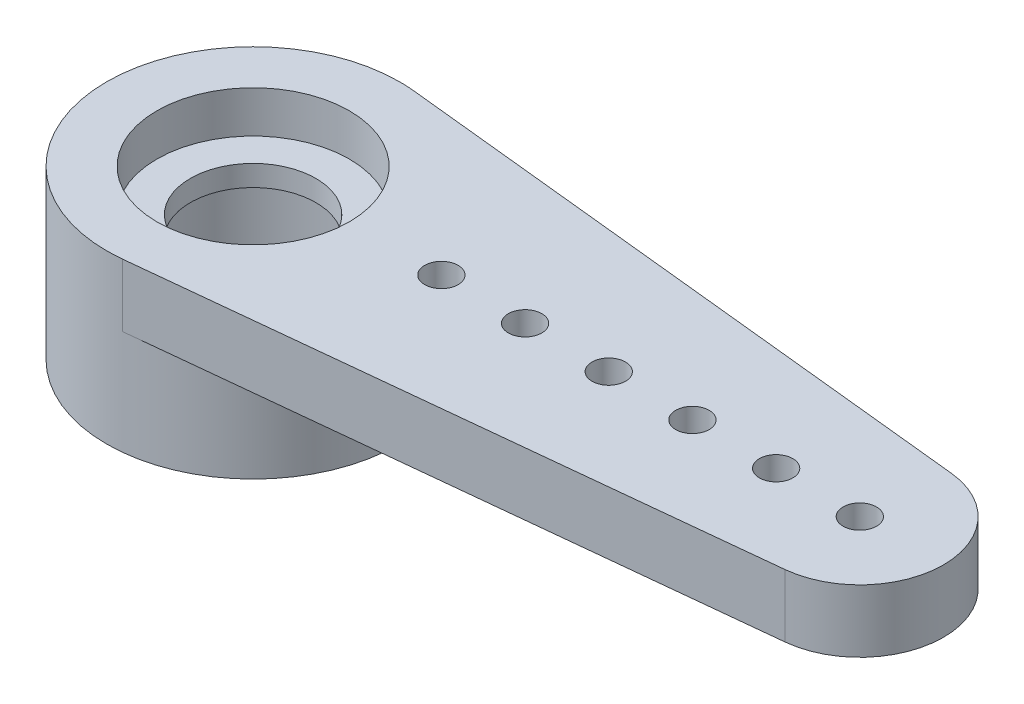
ISO-10303-21;
HEADER;
FILE_DESCRIPTION(('STEP AP214'),'2;1');
FILE_NAME('part.step','',(''),(''),'','','');
FILE_SCHEMA(('AUTOMOTIVE_DESIGN { 1 0 10303 214 1 1 1 1 }'));
ENDSEC;
DATA;
#1=APPLICATION_CONTEXT('core data for automotive mechanical design processes');
#2=APPLICATION_PROTOCOL_DEFINITION('international standard','automotive_design',2000,#1);
#3=PRODUCT_CONTEXT('',#1,'mechanical');
#4=PRODUCT('Part','Part','',(#3));
#5=PRODUCT_RELATED_PRODUCT_CATEGORY('part','',(#4));
#6=PRODUCT_DEFINITION_FORMATION('','',#4);
#7=PRODUCT_DEFINITION_CONTEXT('part definition',#1,'design');
#8=PRODUCT_DEFINITION('design','',#6,#7);
#9=PRODUCT_DEFINITION_SHAPE('','',#8);
#10=(LENGTH_UNIT() NAMED_UNIT(*) SI_UNIT(.MILLI.,.METRE.));
#11=(NAMED_UNIT(*) PLANE_ANGLE_UNIT() SI_UNIT($,.RADIAN.));
#12=(NAMED_UNIT(*) SI_UNIT($,.STERADIAN.) SOLID_ANGLE_UNIT());
#13=UNCERTAINTY_MEASURE_WITH_UNIT(LENGTH_MEASURE(1.E-05),#10,'distance_accuracy_value','');
#14=(GEOMETRIC_REPRESENTATION_CONTEXT(3) GLOBAL_UNCERTAINTY_ASSIGNED_CONTEXT((#13)) GLOBAL_UNIT_ASSIGNED_CONTEXT((#10,
#11,#12)) REPRESENTATION_CONTEXT('',''));
#15=CARTESIAN_POINT('',(0.,0.,0.));
#16=DIRECTION('',(0.,0.,1.));
#17=DIRECTION('',(1.,0.,0.));
#18=AXIS2_PLACEMENT_3D('',#15,#16,#17);
#19=CARTESIAN_POINT('',(4.5,1.5,0.));
#20=DIRECTION('',(0.,-1.,0.));
#21=DIRECTION('',(0.,0.,-1.));
#22=AXIS2_PLACEMENT_3D('',#19,#20,#21);
#23=CYLINDRICAL_SURFACE('',#22,0.4);
#24=CARTESIAN_POINT('',(4.5,1.5,0.));
#25=DIRECTION('',(0.,1.,0.));
#26=DIRECTION('',(0.,0.,1.));
#27=AXIS2_PLACEMENT_3D('',#24,#25,#26);
#28=CIRCLE('',#27,0.4);
#29=CARTESIAN_POINT('',(4.5,1.5,0.4));
#30=VERTEX_POINT('',#29);
#31=EDGE_CURVE('E44',#30,#30,#28,.T.);
#32=ORIENTED_EDGE('',*,*,#31,.T.);
#33=EDGE_LOOP('',(#32));
#34=FACE_BOUND('',#33,.T.);
#35=CARTESIAN_POINT('',(4.5,0.,0.));
#36=DIRECTION('',(0.,1.,0.));
#37=DIRECTION('',(0.,0.,1.));
#38=AXIS2_PLACEMENT_3D('',#35,#36,#37);
#39=CIRCLE('',#38,0.4);
#40=CARTESIAN_POINT('',(4.5,0.,0.4));
#41=VERTEX_POINT('',#40);
#42=EDGE_CURVE('E11',#41,#41,#39,.T.);
#43=ORIENTED_EDGE('',*,*,#42,.F.);
#44=EDGE_LOOP('',(#43));
#45=FACE_BOUND('',#44,.T.);
#46=ADVANCED_FACE('F36',(#34,#45),#23,.F.);
#47=CARTESIAN_POINT('',(6.5,1.5,0.));
#48=DIRECTION('',(0.,-1.,0.));
#49=DIRECTION('',(0.,0.,-1.));
#50=AXIS2_PLACEMENT_3D('',#47,#48,#49);
#51=CYLINDRICAL_SURFACE('',#50,0.4);
#52=CARTESIAN_POINT('',(6.5,1.5,0.));
#53=DIRECTION('',(0.,1.,0.));
#54=DIRECTION('',(0.,0.,1.));
#55=AXIS2_PLACEMENT_3D('',#52,#53,#54);
#56=CIRCLE('',#55,0.4);
#57=CARTESIAN_POINT('',(6.5,1.5,0.4));
#58=VERTEX_POINT('',#57);
#59=EDGE_CURVE('E137',#58,#58,#56,.T.);
#60=ORIENTED_EDGE('',*,*,#59,.T.);
#61=EDGE_LOOP('',(#60));
#62=FACE_BOUND('',#61,.T.);
#63=CARTESIAN_POINT('',(6.5,0.,0.));
#64=DIRECTION('',(0.,1.,0.));
#65=DIRECTION('',(0.,0.,1.));
#66=AXIS2_PLACEMENT_3D('',#63,#64,#65);
#67=CIRCLE('',#66,0.4);
#68=CARTESIAN_POINT('',(6.5,0.,0.4));
#69=VERTEX_POINT('',#68);
#70=EDGE_CURVE('E140',#69,#69,#67,.T.);
#71=ORIENTED_EDGE('',*,*,#70,.F.);
#72=EDGE_LOOP('',(#71));
#73=FACE_BOUND('',#72,.T.);
#74=ADVANCED_FACE('F231',(#62,#73),#51,.F.);
#75=CARTESIAN_POINT('',(8.5,1.5,0.));
#76=DIRECTION('',(0.,-1.,0.));
#77=DIRECTION('',(0.,0.,-1.));
#78=AXIS2_PLACEMENT_3D('',#75,#76,#77);
#79=CYLINDRICAL_SURFACE('',#78,0.4);
#80=CARTESIAN_POINT('',(8.5,1.5,0.));
#81=DIRECTION('',(0.,1.,0.));
#82=DIRECTION('',(0.,0.,1.));
#83=AXIS2_PLACEMENT_3D('',#80,#81,#82);
#84=CIRCLE('',#83,0.4);
#85=CARTESIAN_POINT('',(8.5,1.5,0.4));
#86=VERTEX_POINT('',#85);
#87=EDGE_CURVE('E131',#86,#86,#84,.T.);
#88=ORIENTED_EDGE('',*,*,#87,.T.);
#89=EDGE_LOOP('',(#88));
#90=FACE_BOUND('',#89,.T.);
#91=CARTESIAN_POINT('',(8.5,0.,0.));
#92=DIRECTION('',(0.,1.,0.));
#93=DIRECTION('',(0.,0.,1.));
#94=AXIS2_PLACEMENT_3D('',#91,#92,#93);
#95=CIRCLE('',#94,0.4);
#96=CARTESIAN_POINT('',(8.5,0.,0.4));
#97=VERTEX_POINT('',#96);
#98=EDGE_CURVE('E134',#97,#97,#95,.T.);
#99=ORIENTED_EDGE('',*,*,#98,.F.);
#100=EDGE_LOOP('',(#99));
#101=FACE_BOUND('',#100,.T.);
#102=ADVANCED_FACE('F235',(#90,#101),#79,.F.);
#103=CARTESIAN_POINT('',(10.5,1.5,0.));
#104=DIRECTION('',(0.,-1.,0.));
#105=DIRECTION('',(0.,0.,-1.));
#106=AXIS2_PLACEMENT_3D('',#103,#104,#105);
#107=CYLINDRICAL_SURFACE('',#106,0.4);
#108=CARTESIAN_POINT('',(10.5,1.5,0.));
#109=DIRECTION('',(0.,1.,0.));
#110=DIRECTION('',(0.,0.,1.));
#111=AXIS2_PLACEMENT_3D('',#108,#109,#110);
#112=CIRCLE('',#111,0.4);
#113=CARTESIAN_POINT('',(10.5,1.5,0.4));
#114=VERTEX_POINT('',#113);
#115=EDGE_CURVE('E125',#114,#114,#112,.T.);
#116=ORIENTED_EDGE('',*,*,#115,.T.);
#117=EDGE_LOOP('',(#116));
#118=FACE_BOUND('',#117,.T.);
#119=CARTESIAN_POINT('',(10.5,0.,0.));
#120=DIRECTION('',(0.,1.,0.));
#121=DIRECTION('',(0.,0.,1.));
#122=AXIS2_PLACEMENT_3D('',#119,#120,#121);
#123=CIRCLE('',#122,0.4);
#124=CARTESIAN_POINT('',(10.5,0.,0.4));
#125=VERTEX_POINT('',#124);
#126=EDGE_CURVE('E128',#125,#125,#123,.T.);
#127=ORIENTED_EDGE('',*,*,#126,.F.);
#128=EDGE_LOOP('',(#127));
#129=FACE_BOUND('',#128,.T.);
#130=ADVANCED_FACE('F240',(#118,#129),#107,.F.);
#131=CARTESIAN_POINT('',(12.5,1.5,0.));
#132=DIRECTION('',(0.,-1.,0.));
#133=DIRECTION('',(0.,0.,-1.));
#134=AXIS2_PLACEMENT_3D('',#131,#132,#133);
#135=CYLINDRICAL_SURFACE('',#134,0.4);
#136=CARTESIAN_POINT('',(12.5,1.5,0.));
#137=DIRECTION('',(0.,1.,0.));
#138=DIRECTION('',(0.,0.,1.));
#139=AXIS2_PLACEMENT_3D('',#136,#137,#138);
#140=CIRCLE('',#139,0.4);
#141=CARTESIAN_POINT('',(12.5,1.5,0.4));
#142=VERTEX_POINT('',#141);
#143=EDGE_CURVE('E118',#142,#142,#140,.T.);
#144=ORIENTED_EDGE('',*,*,#143,.T.);
#145=EDGE_LOOP('',(#144));
#146=FACE_BOUND('',#145,.T.);
#147=CARTESIAN_POINT('',(12.5,0.,0.));
#148=DIRECTION('',(0.,1.,0.));
#149=DIRECTION('',(0.,0.,1.));
#150=AXIS2_PLACEMENT_3D('',#147,#148,#149);
#151=CIRCLE('',#150,0.4);
#152=CARTESIAN_POINT('',(12.5,0.,0.4));
#153=VERTEX_POINT('',#152);
#154=EDGE_CURVE('E121',#153,#153,#151,.T.);
#155=ORIENTED_EDGE('',*,*,#154,.F.);
#156=EDGE_LOOP('',(#155));
#157=FACE_BOUND('',#156,.T.);
#158=ADVANCED_FACE('F199',(#146,#157),#135,.F.);
#159=CARTESIAN_POINT('',(0.,1.5,0.));
#160=DIRECTION('',(0.,-1.,0.));
#161=DIRECTION('',(0.,0.,-1.));
#162=AXIS2_PLACEMENT_3D('',#159,#160,#161);
#163=CYLINDRICAL_SURFACE('',#162,1.5);
#164=CARTESIAN_POINT('',(0.,0.,0.));
#165=DIRECTION('',(0.,1.,0.));
#166=DIRECTION('',(0.,0.,1.));
#167=AXIS2_PLACEMENT_3D('',#164,#165,#166);
#168=CIRCLE('',#167,1.5);
#169=CARTESIAN_POINT('',(0.,0.,1.5));
#170=VERTEX_POINT('',#169);
#171=EDGE_CURVE('E185',#170,#170,#168,.T.);
#172=ORIENTED_EDGE('',*,*,#171,.F.);
#173=EDGE_LOOP('',(#172));
#174=FACE_BOUND('',#173,.T.);
#175=CARTESIAN_POINT('',(0.,0.5,0.));
#176=DIRECTION('',(0.,1.,0.));
#177=DIRECTION('',(0.,0.,1.));
#178=AXIS2_PLACEMENT_3D('',#175,#176,#177);
#179=CIRCLE('',#178,1.5);
#180=CARTESIAN_POINT('',(0.,0.5,1.5));
#181=VERTEX_POINT('',#180);
#182=EDGE_CURVE('E113',#181,#181,#179,.T.);
#183=ORIENTED_EDGE('',*,*,#182,.T.);
#184=EDGE_LOOP('',(#183));
#185=FACE_BOUND('',#184,.T.);
#186=ADVANCED_FACE('F196',(#174,#185),#163,.F.);
#187=CARTESIAN_POINT('',(0.,0.,0.));
#188=DIRECTION('',(0.,1.,0.));
#189=DIRECTION('',(0.,0.,1.));
#190=AXIS2_PLACEMENT_3D('',#187,#188,#189);
#191=PLANE('',#190);
#192=ORIENTED_EDGE('',*,*,#171,.T.);
#193=EDGE_LOOP('',(#192));
#194=FACE_BOUND('',#193,.T.);
#195=CARTESIAN_POINT('',(0.,0.,0.));
#196=DIRECTION('',(0.,-1.,0.));
#197=DIRECTION('',(0.,0.,-1.));
#198=AXIS2_PLACEMENT_3D('',#195,#196,#197);
#199=CIRCLE('',#198,2.5);
#200=CARTESIAN_POINT('',(0.,0.,-2.5));
#201=VERTEX_POINT('',#200);
#202=EDGE_CURVE('E116',#201,#201,#199,.T.);
#203=ORIENTED_EDGE('',*,*,#202,.T.);
#204=EDGE_LOOP('',(#203));
#205=FACE_BOUND('',#204,.T.);
#206=ADVANCED_FACE('F193',(#194,#205),#191,.F.);
#207=CARTESIAN_POINT('',(0.362068965517241,1.5,3.48122192113764));
#208=DIRECTION('',(-0.103448275862069,0.,-0.994634834610756));
#209=DIRECTION('',(-0.994634834610756,0.,0.103448275862069));
#210=AXIS2_PLACEMENT_3D('',#207,#208,#209);
#211=PLANE('',#210);
#212=DIRECTION('',(0.994634834610756,0.,-0.103448275862069));
#213=VECTOR('',#212,1.);
#214=CARTESIAN_POINT('',(0.362068965517241,0.,3.48122192113764));
#215=LINE('',#214,#213);
#216=CARTESIAN_POINT('',(0.362068965517241,0.,3.48122192113764));
#217=VERTEX_POINT('',#216);
#218=CARTESIAN_POINT('',(14.7068965517241,0.,1.98926966922151));
#219=VERTEX_POINT('',#218);
#220=EDGE_CURVE('E91',#217,#219,#215,.T.);
#221=ORIENTED_EDGE('',*,*,#220,.T.);
#222=DIRECTION('',(0.,-1.,0.));
#223=VECTOR('',#222,1.);
#224=CARTESIAN_POINT('',(14.7068965517241,1.5,1.98926966922151));
#225=LINE('',#224,#223);
#226=CARTESIAN_POINT('',(14.7068965517241,1.5,1.98926966922151));
#227=VERTEX_POINT('',#226);
#228=EDGE_CURVE('E122',#227,#219,#225,.T.);
#229=ORIENTED_EDGE('',*,*,#228,.F.);
#230=DIRECTION('',(0.994634834610756,0.,-0.103448275862069));
#231=VECTOR('',#230,1.);
#232=CARTESIAN_POINT('',(0.362068965517241,1.5,3.48122192113764));
#233=LINE('',#232,#231);
#234=CARTESIAN_POINT('',(0.362068965517241,1.5,3.48122192113764));
#235=VERTEX_POINT('',#234);
#236=EDGE_CURVE('E105',#235,#227,#233,.T.);
#237=ORIENTED_EDGE('',*,*,#236,.F.);
#238=DIRECTION('',(0.,-1.,0.));
#239=VECTOR('',#238,1.);
#240=CARTESIAN_POINT('',(0.362068965517241,1.5,3.48122192113764));
#241=LINE('',#240,#239);
#242=EDGE_CURVE('E98',#235,#217,#241,.T.);
#243=ORIENTED_EDGE('',*,*,#242,.T.);
#244=EDGE_LOOP('',(#221,#229,#237,#243));
#245=FACE_BOUND('',#244,.T.);
#246=ADVANCED_FACE('F168',(#245),#211,.F.);
#247=CARTESIAN_POINT('',(14.5,1.5,0.));
#248=DIRECTION('',(0.,-1.,0.));
#249=DIRECTION('',(0.,0.,-1.));
#250=AXIS2_PLACEMENT_3D('',#247,#248,#249);
#251=CYLINDRICAL_SURFACE('',#250,2.);
#252=CARTESIAN_POINT('',(14.5,0.,0.));
#253=DIRECTION('',(0.,1.,0.));
#254=DIRECTION('',(0.,0.,1.));
#255=AXIS2_PLACEMENT_3D('',#252,#253,#254);
#256=CIRCLE('',#255,2.);
#257=CARTESIAN_POINT('',(14.7068965517241,0.,-1.98926966922151));
#258=VERTEX_POINT('',#257);
#259=EDGE_CURVE('E102',#219,#258,#256,.T.);
#260=ORIENTED_EDGE('',*,*,#259,.T.);
#261=DIRECTION('',(0.,-1.,0.));
#262=VECTOR('',#261,1.);
#263=CARTESIAN_POINT('',(14.7068965517241,1.5,-1.98926966922151));
#264=LINE('',#263,#262);
#265=CARTESIAN_POINT('',(14.7068965517241,1.5,-1.98926966922151));
#266=VERTEX_POINT('',#265);
#267=EDGE_CURVE('E68',#266,#258,#264,.T.);
#268=ORIENTED_EDGE('',*,*,#267,.F.);
#269=CARTESIAN_POINT('',(14.5,1.5,0.));
#270=DIRECTION('',(0.,1.,0.));
#271=DIRECTION('',(0.,0.,1.));
#272=AXIS2_PLACEMENT_3D('',#269,#270,#271);
#273=CIRCLE('',#272,2.);
#274=EDGE_CURVE('E82',#227,#266,#273,.T.);
#275=ORIENTED_EDGE('',*,*,#274,.F.);
#276=ORIENTED_EDGE('',*,*,#228,.T.);
#277=EDGE_LOOP('',(#260,#268,#275,#276));
#278=FACE_BOUND('',#277,.T.);
#279=ADVANCED_FACE('F257',(#278),#251,.T.);
#280=CARTESIAN_POINT('',(0.362068965517241,1.5,-3.48122192113764));
#281=DIRECTION('',(0.103448275862069,0.,-0.994634834610756));
#282=DIRECTION('',(-0.994634834610756,0.,-0.103448275862069));
#283=AXIS2_PLACEMENT_3D('',#280,#281,#282);
#284=PLANE('',#283);
#285=DIRECTION('',(0.994634834610756,0.,0.103448275862069));
#286=VECTOR('',#285,1.);
#287=CARTESIAN_POINT('',(0.362068965517241,0.,-3.48122192113764));
#288=LINE('',#287,#286);
#289=CARTESIAN_POINT('',(0.362068965517241,0.,-3.48122192113764));
#290=VERTEX_POINT('',#289);
#291=EDGE_CURVE('E89',#290,#258,#288,.T.);
#292=ORIENTED_EDGE('',*,*,#291,.F.);
#293=DIRECTION('',(0.,-1.,0.));
#294=VECTOR('',#293,1.);
#295=CARTESIAN_POINT('',(0.362068965517241,1.5,-3.48122192113764));
#296=LINE('',#295,#294);
#297=CARTESIAN_POINT('',(0.362068965517241,1.5,-3.48122192113764));
#298=VERTEX_POINT('',#297);
#299=EDGE_CURVE('E95',#298,#290,#296,.T.);
#300=ORIENTED_EDGE('',*,*,#299,.F.);
#301=DIRECTION('',(0.994634834610756,0.,0.103448275862069));
#302=VECTOR('',#301,1.);
#303=CARTESIAN_POINT('',(0.362068965517241,1.5,-3.48122192113764));
#304=LINE('',#303,#302);
#305=EDGE_CURVE('E179',#298,#266,#304,.T.);
#306=ORIENTED_EDGE('',*,*,#305,.T.);
#307=ORIENTED_EDGE('',*,*,#267,.T.);
#308=EDGE_LOOP('',(#292,#300,#306,#307));
#309=FACE_BOUND('',#308,.T.);
#310=ADVANCED_FACE('F100',(#309),#284,.T.);
#311=CARTESIAN_POINT('',(14.5,1.5,0.));
#312=DIRECTION('',(0.,-1.,0.));
#313=DIRECTION('',(0.,0.,-1.));
#314=AXIS2_PLACEMENT_3D('',#311,#312,#313);
#315=CYLINDRICAL_SURFACE('',#314,0.4);
#316=CARTESIAN_POINT('',(14.5,1.5,0.));
#317=DIRECTION('',(0.,1.,0.));
#318=DIRECTION('',(0.,0.,1.));
#319=AXIS2_PLACEMENT_3D('',#316,#317,#318);
#320=CIRCLE('',#319,0.4);
#321=CARTESIAN_POINT('',(14.5,1.5,0.4));
#322=VERTEX_POINT('',#321);
#323=EDGE_CURVE('E101',#322,#322,#320,.T.);
#324=ORIENTED_EDGE('',*,*,#323,.T.);
#325=EDGE_LOOP('',(#324));
#326=FACE_BOUND('',#325,.T.);
#327=CARTESIAN_POINT('',(14.5,0.,0.));
#328=DIRECTION('',(0.,1.,0.));
#329=DIRECTION('',(0.,0.,1.));
#330=AXIS2_PLACEMENT_3D('',#327,#328,#329);
#331=CIRCLE('',#330,0.4);
#332=CARTESIAN_POINT('',(14.5,0.,0.4));
#333=VERTEX_POINT('',#332);
#334=EDGE_CURVE('E182',#333,#333,#331,.T.);
#335=ORIENTED_EDGE('',*,*,#334,.F.);
#336=EDGE_LOOP('',(#335));
#337=FACE_BOUND('',#336,.T.);
#338=ADVANCED_FACE('F251',(#326,#337),#315,.F.);
#339=CARTESIAN_POINT('',(0.,1.5,0.));
#340=DIRECTION('',(0.,-1.,0.));
#341=DIRECTION('',(0.,0.,-1.));
#342=AXIS2_PLACEMENT_3D('',#339,#340,#341);
#343=CYLINDRICAL_SURFACE('',#342,3.5);
#344=ORIENTED_EDGE('',*,*,#299,.T.);
#345=CARTESIAN_POINT('',(0.,0.,0.));
#346=DIRECTION('',(0.,-1.,0.));
#347=DIRECTION('',(0.,0.,-1.));
#348=AXIS2_PLACEMENT_3D('',#345,#346,#347);
#349=CIRCLE('',#348,3.5);
#350=EDGE_CURVE('E75',#290,#217,#349,.T.);
#351=ORIENTED_EDGE('',*,*,#350,.T.);
#352=ORIENTED_EDGE('',*,*,#242,.F.);
#353=CARTESIAN_POINT('',(0.,1.5,0.));
#354=DIRECTION('',(0.,1.,0.));
#355=DIRECTION('',(0.,0.,1.));
#356=AXIS2_PLACEMENT_3D('',#353,#354,#355);
#357=CIRCLE('',#356,3.5);
#358=EDGE_CURVE('E52',#298,#235,#357,.T.);
#359=ORIENTED_EDGE('',*,*,#358,.F.);
#360=EDGE_LOOP('',(#344,#351,#352,#359));
#361=FACE_BOUND('',#360,.T.);
#362=CARTESIAN_POINT('',(0.,-2.5,0.));
#363=DIRECTION('',(0.,-1.,0.));
#364=DIRECTION('',(0.,0.,-1.));
#365=AXIS2_PLACEMENT_3D('',#362,#363,#364);
#366=CIRCLE('',#365,3.5);
#367=CARTESIAN_POINT('',(0.,-2.5,-3.5));
#368=VERTEX_POINT('',#367);
#369=EDGE_CURVE('E92',#368,#368,#366,.T.);
#370=ORIENTED_EDGE('',*,*,#369,.F.);
#371=EDGE_LOOP('',(#370));
#372=FACE_BOUND('',#371,.T.);
#373=ADVANCED_FACE('F96',(#361,#372),#343,.T.);
#374=CARTESIAN_POINT('',(0.,1.5,0.));
#375=DIRECTION('',(0.,1.,0.));
#376=DIRECTION('',(0.,0.,1.));
#377=AXIS2_PLACEMENT_3D('',#374,#375,#376);
#378=PLANE('',#377);
#379=ORIENTED_EDGE('',*,*,#31,.F.);
#380=EDGE_LOOP('',(#379));
#381=FACE_BOUND('',#380,.T.);
#382=ORIENTED_EDGE('',*,*,#59,.F.);
#383=EDGE_LOOP('',(#382));
#384=FACE_BOUND('',#383,.T.);
#385=ORIENTED_EDGE('',*,*,#87,.F.);
#386=EDGE_LOOP('',(#385));
#387=FACE_BOUND('',#386,.T.);
#388=ORIENTED_EDGE('',*,*,#115,.F.);
#389=EDGE_LOOP('',(#388));
#390=FACE_BOUND('',#389,.T.);
#391=ORIENTED_EDGE('',*,*,#143,.F.);
#392=EDGE_LOOP('',(#391));
#393=FACE_BOUND('',#392,.T.);
#394=CARTESIAN_POINT('',(0.,1.5,0.));
#395=DIRECTION('',(0.,1.,0.));
#396=DIRECTION('',(0.,0.,1.));
#397=AXIS2_PLACEMENT_3D('',#394,#395,#396);
#398=CIRCLE('',#397,2.3);
#399=CARTESIAN_POINT('',(0.,1.5,2.3));
#400=VERTEX_POINT('',#399);
#401=EDGE_CURVE('E162',#400,#400,#398,.T.);
#402=ORIENTED_EDGE('',*,*,#401,.F.);
#403=EDGE_LOOP('',(#402));
#404=FACE_BOUND('',#403,.T.);
#405=ORIENTED_EDGE('',*,*,#323,.F.);
#406=EDGE_LOOP('',(#405));
#407=FACE_BOUND('',#406,.T.);
#408=ORIENTED_EDGE('',*,*,#236,.T.);
#409=ORIENTED_EDGE('',*,*,#274,.T.);
#410=ORIENTED_EDGE('',*,*,#305,.F.);
#411=ORIENTED_EDGE('',*,*,#358,.T.);
#412=EDGE_LOOP('',(#408,#409,#410,#411));
#413=FACE_BOUND('',#412,.T.);
#414=ADVANCED_FACE('F147',(#381,#384,#387,#390,#393,#404,#407,#413),#378,.T.);
#415=ORIENTED_EDGE('',*,*,#42,.T.);
#416=EDGE_LOOP('',(#415));
#417=FACE_BOUND('',#416,.T.);
#418=ORIENTED_EDGE('',*,*,#70,.T.);
#419=EDGE_LOOP('',(#418));
#420=FACE_BOUND('',#419,.T.);
#421=ORIENTED_EDGE('',*,*,#98,.T.);
#422=EDGE_LOOP('',(#421));
#423=FACE_BOUND('',#422,.T.);
#424=ORIENTED_EDGE('',*,*,#126,.T.);
#425=EDGE_LOOP('',(#424));
#426=FACE_BOUND('',#425,.T.);
#427=ORIENTED_EDGE('',*,*,#154,.T.);
#428=EDGE_LOOP('',(#427));
#429=FACE_BOUND('',#428,.T.);
#430=ORIENTED_EDGE('',*,*,#350,.F.);
#431=ORIENTED_EDGE('',*,*,#291,.T.);
#432=ORIENTED_EDGE('',*,*,#259,.F.);
#433=ORIENTED_EDGE('',*,*,#220,.F.);
#434=EDGE_LOOP('',(#430,#431,#432,#433));
#435=FACE_BOUND('',#434,.T.);
#436=ORIENTED_EDGE('',*,*,#334,.T.);
#437=EDGE_LOOP('',(#436));
#438=FACE_BOUND('',#437,.T.);
#439=ADVANCED_FACE('F87',(#417,#420,#423,#426,#429,#435,#438),#191,.F.);
#440=CARTESIAN_POINT('',(0.,-2.5,0.));
#441=DIRECTION('',(0.,-1.,0.));
#442=DIRECTION('',(0.,0.,-1.));
#443=AXIS2_PLACEMENT_3D('',#440,#441,#442);
#444=PLANE('',#443);
#445=ORIENTED_EDGE('',*,*,#369,.T.);
#446=EDGE_LOOP('',(#445));
#447=FACE_BOUND('',#446,.T.);
#448=CARTESIAN_POINT('',(0.,-2.5,0.));
#449=DIRECTION('',(0.,-1.,0.));
#450=DIRECTION('',(0.,0.,-1.));
#451=AXIS2_PLACEMENT_3D('',#448,#449,#450);
#452=CIRCLE('',#451,2.5);
#453=CARTESIAN_POINT('',(0.,-2.5,-2.5));
#454=VERTEX_POINT('',#453);
#455=EDGE_CURVE('E93',#454,#454,#452,.T.);
#456=ORIENTED_EDGE('',*,*,#455,.F.);
#457=EDGE_LOOP('',(#456));
#458=FACE_BOUND('',#457,.T.);
#459=ADVANCED_FACE('F220',(#447,#458),#444,.T.);
#460=CARTESIAN_POINT('',(0.,-2.5,0.));
#461=DIRECTION('',(0.,1.,0.));
#462=DIRECTION('',(0.,0.,1.));
#463=AXIS2_PLACEMENT_3D('',#460,#461,#462);
#464=CYLINDRICAL_SURFACE('',#463,2.5);
#465=ORIENTED_EDGE('',*,*,#455,.T.);
#466=EDGE_LOOP('',(#465));
#467=FACE_BOUND('',#466,.T.);
#468=ORIENTED_EDGE('',*,*,#202,.F.);
#469=EDGE_LOOP('',(#468));
#470=FACE_BOUND('',#469,.T.);
#471=ADVANCED_FACE('F218',(#467,#470),#464,.F.);
#472=CARTESIAN_POINT('',(0.,0.5,0.));
#473=DIRECTION('',(0.,1.,0.));
#474=DIRECTION('',(0.,0.,1.));
#475=AXIS2_PLACEMENT_3D('',#472,#473,#474);
#476=CYLINDRICAL_SURFACE('',#475,2.3);
#477=CARTESIAN_POINT('',(0.,0.5,0.));
#478=DIRECTION('',(0.,1.,0.));
#479=DIRECTION('',(0.,0.,1.));
#480=AXIS2_PLACEMENT_3D('',#477,#478,#479);
#481=CIRCLE('',#480,2.3);
#482=CARTESIAN_POINT('',(0.,0.5,2.3));
#483=VERTEX_POINT('',#482);
#484=EDGE_CURVE('E117',#483,#483,#481,.T.);
#485=ORIENTED_EDGE('',*,*,#484,.F.);
#486=EDGE_LOOP('',(#485));
#487=FACE_BOUND('',#486,.T.);
#488=ORIENTED_EDGE('',*,*,#401,.T.);
#489=EDGE_LOOP('',(#488));
#490=FACE_BOUND('',#489,.T.);
#491=ADVANCED_FACE('F206',(#487,#490),#476,.F.);
#492=CARTESIAN_POINT('',(0.,0.5,0.));
#493=DIRECTION('',(0.,1.,0.));
#494=DIRECTION('',(0.,0.,1.));
#495=AXIS2_PLACEMENT_3D('',#492,#493,#494);
#496=PLANE('',#495);
#497=ORIENTED_EDGE('',*,*,#182,.F.);
#498=EDGE_LOOP('',(#497));
#499=FACE_BOUND('',#498,.T.);
#500=ORIENTED_EDGE('',*,*,#484,.T.);
#501=EDGE_LOOP('',(#500));
#502=FACE_BOUND('',#501,.T.);
#503=ADVANCED_FACE('F203',(#499,#502),#496,.T.);
#504=CLOSED_SHELL('',(#46,#74,#102,#130,#158,#186,#206,#246,#279,#310,#338,#373,#414,#439,#459,
#471,#491,#503));
#505=MANIFOLD_SOLID_BREP('B2',#504);
#506=ADVANCED_BREP_SHAPE_REPRESENTATION('',(#18,#505),#14);
#507=SHAPE_DEFINITION_REPRESENTATION(#9,#506);
ENDSEC;
END-ISO-10303-21;
